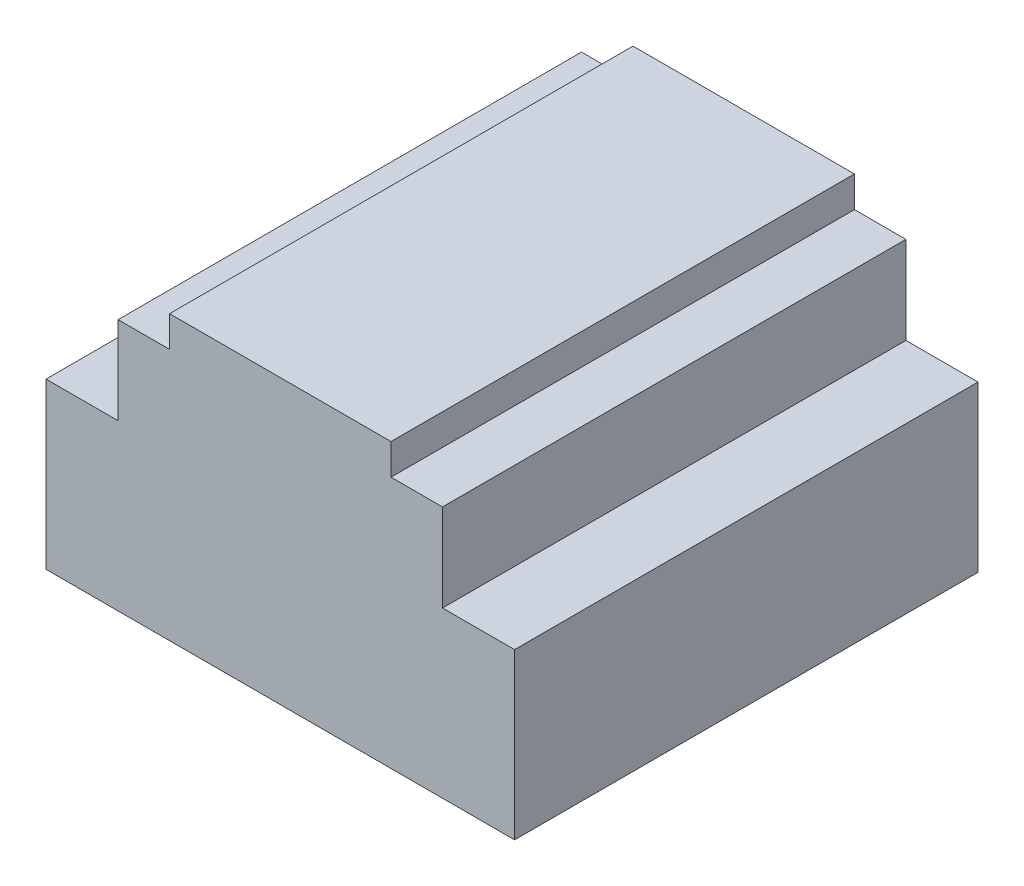
ISO-10303-21;
HEADER;
FILE_DESCRIPTION(('STEP AP214'),'2;1');
FILE_NAME('part.step','',(''),(''),'','','');
FILE_SCHEMA(('AUTOMOTIVE_DESIGN { 1 0 10303 214 1 1 1 1 }'));
ENDSEC;
DATA;
#1=APPLICATION_CONTEXT('core data for automotive mechanical design processes');
#2=APPLICATION_PROTOCOL_DEFINITION('international standard','automotive_design',2000,#1);
#3=PRODUCT_CONTEXT('',#1,'mechanical');
#4=PRODUCT('Part','Part','',(#3));
#5=PRODUCT_RELATED_PRODUCT_CATEGORY('part','',(#4));
#6=PRODUCT_DEFINITION_FORMATION('','',#4);
#7=PRODUCT_DEFINITION_CONTEXT('part definition',#1,'design');
#8=PRODUCT_DEFINITION('design','',#6,#7);
#9=PRODUCT_DEFINITION_SHAPE('','',#8);
#10=(LENGTH_UNIT() NAMED_UNIT(*) SI_UNIT(.MILLI.,.METRE.));
#11=(NAMED_UNIT(*) PLANE_ANGLE_UNIT() SI_UNIT($,.RADIAN.));
#12=(NAMED_UNIT(*) SI_UNIT($,.STERADIAN.) SOLID_ANGLE_UNIT());
#13=UNCERTAINTY_MEASURE_WITH_UNIT(LENGTH_MEASURE(1.E-05),#10,'distance_accuracy_value','');
#14=(GEOMETRIC_REPRESENTATION_CONTEXT(3) GLOBAL_UNCERTAINTY_ASSIGNED_CONTEXT((#13)) GLOBAL_UNIT_ASSIGNED_CONTEXT((#10,
#11,#12)) REPRESENTATION_CONTEXT('',''));
#15=CARTESIAN_POINT('',(0.,0.,0.));
#16=DIRECTION('',(0.,0.,1.));
#17=DIRECTION('',(1.,0.,0.));
#18=AXIS2_PLACEMENT_3D('',#15,#16,#17);
#19=CARTESIAN_POINT('',(0.,55.,90.));
#20=DIRECTION('',(0.,-1.,0.));
#21=DIRECTION('',(0.,0.,-1.));
#22=AXIS2_PLACEMENT_3D('',#19,#20,#21);
#23=PLANE('',#22);
#24=DIRECTION('',(0.,0.,1.));
#25=VECTOR('',#24,1.);
#26=CARTESIAN_POINT('',(24.,55.,0.));
#27=LINE('',#26,#25);
#28=CARTESIAN_POINT('',(24.,55.,0.));
#29=VERTEX_POINT('',#28);
#30=CARTESIAN_POINT('',(24.,55.,90.));
#31=VERTEX_POINT('',#30);
#32=EDGE_CURVE('E186',#29,#31,#27,.T.);
#33=ORIENTED_EDGE('',*,*,#32,.T.);
#34=DIRECTION('',(-1.,0.,0.));
#35=VECTOR('',#34,1.);
#36=CARTESIAN_POINT('',(0.,55.,90.));
#37=LINE('',#36,#35);
#38=CARTESIAN_POINT('',(67.,55.,90.));
#39=VERTEX_POINT('',#38);
#40=EDGE_CURVE('E155',#39,#31,#37,.T.);
#41=ORIENTED_EDGE('',*,*,#40,.F.);
#42=DIRECTION('',(0.,0.,1.));
#43=VECTOR('',#42,1.);
#44=CARTESIAN_POINT('',(67.,55.,0.));
#45=LINE('',#44,#43);
#46=CARTESIAN_POINT('',(67.,55.,0.));
#47=VERTEX_POINT('',#46);
#48=EDGE_CURVE('E148',#47,#39,#45,.T.);
#49=ORIENTED_EDGE('',*,*,#48,.F.);
#50=DIRECTION('',(-1.,0.,0.));
#51=VECTOR('',#50,1.);
#52=CARTESIAN_POINT('',(0.,55.,0.));
#53=LINE('',#52,#51);
#54=EDGE_CURVE('E160',#47,#29,#53,.T.);
#55=ORIENTED_EDGE('',*,*,#54,.T.);
#56=EDGE_LOOP('',(#33,#41,#49,#55));
#57=FACE_BOUND('',#56,.T.);
#58=ADVANCED_FACE('F37',(#57),#23,.F.);
#59=CARTESIAN_POINT('',(0.,0.,90.));
#60=DIRECTION('',(0.,0.,-1.));
#61=DIRECTION('',(-1.,0.,0.));
#62=AXIS2_PLACEMENT_3D('',#59,#60,#61);
#63=PLANE('',#62);
#64=DIRECTION('',(-1.,0.,0.));
#65=VECTOR('',#64,1.);
#66=CARTESIAN_POINT('',(0.,49.,90.));
#67=LINE('',#66,#65);
#68=CARTESIAN_POINT('',(24.,49.,90.));
#69=VERTEX_POINT('',#68);
#70=CARTESIAN_POINT('',(14.,49.,90.));
#71=VERTEX_POINT('',#70);
#72=EDGE_CURVE('E198',#69,#71,#67,.T.);
#73=ORIENTED_EDGE('',*,*,#72,.T.);
#74=DIRECTION('',(0.,1.,0.));
#75=VECTOR('',#74,1.);
#76=CARTESIAN_POINT('',(14.,49.,90.));
#77=LINE('',#76,#75);
#78=CARTESIAN_POINT('',(14.,32.,90.));
#79=VERTEX_POINT('',#78);
#80=EDGE_CURVE('E52',#79,#71,#77,.T.);
#81=ORIENTED_EDGE('',*,*,#80,.F.);
#82=DIRECTION('',(1.,0.,0.));
#83=VECTOR('',#82,1.);
#84=CARTESIAN_POINT('',(0.,32.,90.));
#85=LINE('',#84,#83);
#86=CARTESIAN_POINT('',(0.,32.,90.));
#87=VERTEX_POINT('',#86);
#88=EDGE_CURVE('E224',#87,#79,#85,.T.);
#89=ORIENTED_EDGE('',*,*,#88,.F.);
#90=DIRECTION('',(0.,-1.,0.));
#91=VECTOR('',#90,1.);
#92=CARTESIAN_POINT('',(0.,0.,90.));
#93=LINE('',#92,#91);
#94=CARTESIAN_POINT('',(0.,0.,90.));
#95=VERTEX_POINT('',#94);
#96=EDGE_CURVE('E143',#87,#95,#93,.T.);
#97=ORIENTED_EDGE('',*,*,#96,.T.);
#98=DIRECTION('',(1.,0.,0.));
#99=VECTOR('',#98,1.);
#100=CARTESIAN_POINT('',(0.,0.,90.));
#101=LINE('',#100,#99);
#102=CARTESIAN_POINT('',(91.,0.,90.));
#103=VERTEX_POINT('',#102);
#104=EDGE_CURVE('E173',#95,#103,#101,.T.);
#105=ORIENTED_EDGE('',*,*,#104,.T.);
#106=DIRECTION('',(0.,1.,0.));
#107=VECTOR('',#106,1.);
#108=CARTESIAN_POINT('',(91.,0.,90.));
#109=LINE('',#108,#107);
#110=CARTESIAN_POINT('',(91.,32.,90.));
#111=VERTEX_POINT('',#110);
#112=EDGE_CURVE('E167',#103,#111,#109,.T.);
#113=ORIENTED_EDGE('',*,*,#112,.T.);
#114=DIRECTION('',(1.,0.,0.));
#115=VECTOR('',#114,1.);
#116=CARTESIAN_POINT('',(91.,32.,90.));
#117=LINE('',#116,#115);
#118=CARTESIAN_POINT('',(77.,32.,90.));
#119=VERTEX_POINT('',#118);
#120=EDGE_CURVE('E212',#119,#111,#117,.T.);
#121=ORIENTED_EDGE('',*,*,#120,.F.);
#122=DIRECTION('',(0.,-1.,0.));
#123=VECTOR('',#122,1.);
#124=CARTESIAN_POINT('',(77.,49.,90.));
#125=LINE('',#124,#123);
#126=CARTESIAN_POINT('',(77.,49.,90.));
#127=VERTEX_POINT('',#126);
#128=EDGE_CURVE('E214',#127,#119,#125,.T.);
#129=ORIENTED_EDGE('',*,*,#128,.F.);
#130=DIRECTION('',(1.,0.,0.));
#131=VECTOR('',#130,1.);
#132=CARTESIAN_POINT('',(0.,49.,90.));
#133=LINE('',#132,#131);
#134=CARTESIAN_POINT('',(67.,49.,90.));
#135=VERTEX_POINT('',#134);
#136=EDGE_CURVE('E180',#135,#127,#133,.T.);
#137=ORIENTED_EDGE('',*,*,#136,.F.);
#138=DIRECTION('',(0.,1.,0.));
#139=VECTOR('',#138,1.);
#140=CARTESIAN_POINT('',(66.9999999999999,-1.54968630520594E-13,90.));
#141=LINE('',#140,#139);
#142=EDGE_CURVE('E184',#135,#39,#141,.T.);
#143=ORIENTED_EDGE('',*,*,#142,.T.);
#144=ORIENTED_EDGE('',*,*,#40,.T.);
#145=DIRECTION('',(0.,-1.,0.));
#146=VECTOR('',#145,1.);
#147=CARTESIAN_POINT('',(24.,0.,90.));
#148=LINE('',#147,#146);
#149=EDGE_CURVE('E195',#31,#69,#148,.T.);
#150=ORIENTED_EDGE('',*,*,#149,.T.);
#151=EDGE_LOOP('',(#73,#81,#89,#97,#105,#113,#121,#129,#137,#143,#144,#150));
#152=FACE_BOUND('',#151,.T.);
#153=ADVANCED_FACE('F242',(#152),#63,.F.);
#154=CARTESIAN_POINT('',(0.,0.,0.));
#155=DIRECTION('',(0.,0.,-1.));
#156=DIRECTION('',(-1.,0.,0.));
#157=AXIS2_PLACEMENT_3D('',#154,#155,#156);
#158=PLANE('',#157);
#159=DIRECTION('',(0.,1.,0.));
#160=VECTOR('',#159,1.);
#161=CARTESIAN_POINT('',(14.,49.,0.));
#162=LINE('',#161,#160);
#163=CARTESIAN_POINT('',(14.,32.,0.));
#164=VERTEX_POINT('',#163);
#165=CARTESIAN_POINT('',(14.,49.,0.));
#166=VERTEX_POINT('',#165);
#167=EDGE_CURVE('E136',#164,#166,#162,.T.);
#168=ORIENTED_EDGE('',*,*,#167,.T.);
#169=DIRECTION('',(-1.,0.,0.));
#170=VECTOR('',#169,1.);
#171=CARTESIAN_POINT('',(0.,49.,0.));
#172=LINE('',#171,#170);
#173=CARTESIAN_POINT('',(24.,49.,0.));
#174=VERTEX_POINT('',#173);
#175=EDGE_CURVE('E197',#174,#166,#172,.T.);
#176=ORIENTED_EDGE('',*,*,#175,.F.);
#177=DIRECTION('',(0.,-1.,0.));
#178=VECTOR('',#177,1.);
#179=CARTESIAN_POINT('',(24.,0.,0.));
#180=LINE('',#179,#178);
#181=EDGE_CURVE('E192',#29,#174,#180,.T.);
#182=ORIENTED_EDGE('',*,*,#181,.F.);
#183=ORIENTED_EDGE('',*,*,#54,.F.);
#184=DIRECTION('',(0.,1.,0.));
#185=VECTOR('',#184,1.);
#186=CARTESIAN_POINT('',(66.9999999999999,-1.54968630520594E-13,0.));
#187=LINE('',#186,#185);
#188=CARTESIAN_POINT('',(67.,49.,0.));
#189=VERTEX_POINT('',#188);
#190=EDGE_CURVE('E183',#189,#47,#187,.T.);
#191=ORIENTED_EDGE('',*,*,#190,.F.);
#192=DIRECTION('',(1.,0.,0.));
#193=VECTOR('',#192,1.);
#194=CARTESIAN_POINT('',(0.,49.,0.));
#195=LINE('',#194,#193);
#196=CARTESIAN_POINT('',(77.,49.,0.));
#197=VERTEX_POINT('',#196);
#198=EDGE_CURVE('E178',#189,#197,#195,.T.);
#199=ORIENTED_EDGE('',*,*,#198,.T.);
#200=DIRECTION('',(0.,-1.,0.));
#201=VECTOR('',#200,1.);
#202=CARTESIAN_POINT('',(77.,49.,0.));
#203=LINE('',#202,#201);
#204=CARTESIAN_POINT('',(77.,32.,0.));
#205=VERTEX_POINT('',#204);
#206=EDGE_CURVE('E60',#197,#205,#203,.T.);
#207=ORIENTED_EDGE('',*,*,#206,.T.);
#208=DIRECTION('',(1.,0.,0.));
#209=VECTOR('',#208,1.);
#210=CARTESIAN_POINT('',(91.,32.,0.));
#211=LINE('',#210,#209);
#212=CARTESIAN_POINT('',(91.,32.,0.));
#213=VERTEX_POINT('',#212);
#214=EDGE_CURVE('E208',#205,#213,#211,.T.);
#215=ORIENTED_EDGE('',*,*,#214,.T.);
#216=DIRECTION('',(0.,1.,0.));
#217=VECTOR('',#216,1.);
#218=CARTESIAN_POINT('',(91.,0.,0.));
#219=LINE('',#218,#217);
#220=CARTESIAN_POINT('',(91.,0.,0.));
#221=VERTEX_POINT('',#220);
#222=EDGE_CURVE('E150',#221,#213,#219,.T.);
#223=ORIENTED_EDGE('',*,*,#222,.F.);
#224=DIRECTION('',(1.,0.,0.));
#225=VECTOR('',#224,1.);
#226=CARTESIAN_POINT('',(0.,0.,0.));
#227=LINE('',#226,#225);
#228=CARTESIAN_POINT('',(0.,0.,0.));
#229=VERTEX_POINT('',#228);
#230=EDGE_CURVE('E147',#229,#221,#227,.T.);
#231=ORIENTED_EDGE('',*,*,#230,.F.);
#232=DIRECTION('',(0.,-1.,0.));
#233=VECTOR('',#232,1.);
#234=CARTESIAN_POINT('',(0.,0.,0.));
#235=LINE('',#234,#233);
#236=CARTESIAN_POINT('',(0.,32.,0.));
#237=VERTEX_POINT('',#236);
#238=EDGE_CURVE('E141',#237,#229,#235,.T.);
#239=ORIENTED_EDGE('',*,*,#238,.F.);
#240=DIRECTION('',(1.,0.,0.));
#241=VECTOR('',#240,1.);
#242=CARTESIAN_POINT('',(0.,32.,0.));
#243=LINE('',#242,#241);
#244=EDGE_CURVE('E125',#237,#164,#243,.T.);
#245=ORIENTED_EDGE('',*,*,#244,.T.);
#246=EDGE_LOOP('',(#168,#176,#182,#183,#191,#199,#207,#215,#223,#231,#239,#245));
#247=FACE_BOUND('',#246,.T.);
#248=ADVANCED_FACE('F145',(#247),#158,.T.);
#249=CARTESIAN_POINT('',(0.,0.,90.));
#250=DIRECTION('',(1.,0.,0.));
#251=DIRECTION('',(0.,0.,-1.));
#252=AXIS2_PLACEMENT_3D('',#249,#250,#251);
#253=PLANE('',#252);
#254=ORIENTED_EDGE('',*,*,#96,.F.);
#255=DIRECTION('',(0.,0.,1.));
#256=VECTOR('',#255,1.);
#257=CARTESIAN_POINT('',(0.,32.,0.));
#258=LINE('',#257,#256);
#259=EDGE_CURVE('E129',#237,#87,#258,.T.);
#260=ORIENTED_EDGE('',*,*,#259,.F.);
#261=ORIENTED_EDGE('',*,*,#238,.T.);
#262=DIRECTION('',(0.,0.,-1.));
#263=VECTOR('',#262,1.);
#264=CARTESIAN_POINT('',(0.,0.,90.));
#265=LINE('',#264,#263);
#266=EDGE_CURVE('E11',#95,#229,#265,.T.);
#267=ORIENTED_EDGE('',*,*,#266,.F.);
#268=EDGE_LOOP('',(#254,#260,#261,#267));
#269=FACE_BOUND('',#268,.T.);
#270=ADVANCED_FACE('F39',(#269),#253,.F.);
#271=CARTESIAN_POINT('',(0.,0.,90.));
#272=DIRECTION('',(0.,1.,0.));
#273=DIRECTION('',(0.,0.,1.));
#274=AXIS2_PLACEMENT_3D('',#271,#272,#273);
#275=PLANE('',#274);
#276=ORIENTED_EDGE('',*,*,#230,.T.);
#277=DIRECTION('',(0.,0.,-1.));
#278=VECTOR('',#277,1.);
#279=CARTESIAN_POINT('',(91.,0.,90.));
#280=LINE('',#279,#278);
#281=EDGE_CURVE('E45',#103,#221,#280,.T.);
#282=ORIENTED_EDGE('',*,*,#281,.F.);
#283=ORIENTED_EDGE('',*,*,#104,.F.);
#284=ORIENTED_EDGE('',*,*,#266,.T.);
#285=EDGE_LOOP('',(#276,#282,#283,#284));
#286=FACE_BOUND('',#285,.T.);
#287=ADVANCED_FACE('F271',(#286),#275,.F.);
#288=CARTESIAN_POINT('',(91.,0.,90.));
#289=DIRECTION('',(-1.,0.,0.));
#290=DIRECTION('',(0.,0.,1.));
#291=AXIS2_PLACEMENT_3D('',#288,#289,#290);
#292=PLANE('',#291);
#293=ORIENTED_EDGE('',*,*,#222,.T.);
#294=DIRECTION('',(0.,0.,1.));
#295=VECTOR('',#294,1.);
#296=CARTESIAN_POINT('',(91.,32.,0.));
#297=LINE('',#296,#295);
#298=EDGE_CURVE('E201',#213,#111,#297,.T.);
#299=ORIENTED_EDGE('',*,*,#298,.T.);
#300=ORIENTED_EDGE('',*,*,#112,.F.);
#301=ORIENTED_EDGE('',*,*,#281,.T.);
#302=EDGE_LOOP('',(#293,#299,#300,#301));
#303=FACE_BOUND('',#302,.T.);
#304=ADVANCED_FACE('F249',(#303),#292,.F.);
#305=CARTESIAN_POINT('',(66.9999999999999,-1.54968630520594E-13,0.));
#306=DIRECTION('',(1.,0.,0.));
#307=DIRECTION('',(0.,1.,0.));
#308=AXIS2_PLACEMENT_3D('',#305,#306,#307);
#309=PLANE('',#308);
#310=ORIENTED_EDGE('',*,*,#142,.F.);
#311=DIRECTION('',(0.,0.,1.));
#312=VECTOR('',#311,1.);
#313=CARTESIAN_POINT('',(67.,49.,0.));
#314=LINE('',#313,#312);
#315=EDGE_CURVE('E152',#189,#135,#314,.T.);
#316=ORIENTED_EDGE('',*,*,#315,.F.);
#317=ORIENTED_EDGE('',*,*,#190,.T.);
#318=ORIENTED_EDGE('',*,*,#48,.T.);
#319=EDGE_LOOP('',(#310,#316,#317,#318));
#320=FACE_BOUND('',#319,.T.);
#321=ADVANCED_FACE('F240',(#320),#309,.T.);
#322=CARTESIAN_POINT('',(0.,49.,0.));
#323=DIRECTION('',(0.,-1.,0.));
#324=DIRECTION('',(0.,0.,-1.));
#325=AXIS2_PLACEMENT_3D('',#322,#323,#324);
#326=PLANE('',#325);
#327=ORIENTED_EDGE('',*,*,#136,.T.);
#328=DIRECTION('',(0.,0.,1.));
#329=VECTOR('',#328,1.);
#330=CARTESIAN_POINT('',(77.,49.,0.));
#331=LINE('',#330,#329);
#332=EDGE_CURVE('E205',#197,#127,#331,.T.);
#333=ORIENTED_EDGE('',*,*,#332,.F.);
#334=ORIENTED_EDGE('',*,*,#198,.F.);
#335=ORIENTED_EDGE('',*,*,#315,.T.);
#336=EDGE_LOOP('',(#327,#333,#334,#335));
#337=FACE_BOUND('',#336,.T.);
#338=ADVANCED_FACE('F245',(#337),#326,.F.);
#339=CARTESIAN_POINT('',(0.,49.,0.));
#340=DIRECTION('',(0.,1.,0.));
#341=DIRECTION('',(0.,0.,1.));
#342=AXIS2_PLACEMENT_3D('',#339,#340,#341);
#343=PLANE('',#342);
#344=DIRECTION('',(0.,0.,1.));
#345=VECTOR('',#344,1.);
#346=CARTESIAN_POINT('',(14.,49.,0.));
#347=LINE('',#346,#345);
#348=EDGE_CURVE('E217',#166,#71,#347,.T.);
#349=ORIENTED_EDGE('',*,*,#348,.T.);
#350=ORIENTED_EDGE('',*,*,#72,.F.);
#351=DIRECTION('',(0.,0.,1.));
#352=VECTOR('',#351,1.);
#353=CARTESIAN_POINT('',(24.,49.,0.));
#354=LINE('',#353,#352);
#355=EDGE_CURVE('E190',#174,#69,#354,.T.);
#356=ORIENTED_EDGE('',*,*,#355,.F.);
#357=ORIENTED_EDGE('',*,*,#175,.T.);
#358=EDGE_LOOP('',(#349,#350,#356,#357));
#359=FACE_BOUND('',#358,.T.);
#360=ADVANCED_FACE('F230',(#359),#343,.T.);
#361=CARTESIAN_POINT('',(24.,0.,0.));
#362=DIRECTION('',(-1.,0.,0.));
#363=DIRECTION('',(0.,0.,1.));
#364=AXIS2_PLACEMENT_3D('',#361,#362,#363);
#365=PLANE('',#364);
#366=ORIENTED_EDGE('',*,*,#149,.F.);
#367=ORIENTED_EDGE('',*,*,#32,.F.);
#368=ORIENTED_EDGE('',*,*,#181,.T.);
#369=ORIENTED_EDGE('',*,*,#355,.T.);
#370=EDGE_LOOP('',(#366,#367,#368,#369));
#371=FACE_BOUND('',#370,.T.);
#372=ADVANCED_FACE('F233',(#371),#365,.T.);
#373=CARTESIAN_POINT('',(91.,32.,0.));
#374=DIRECTION('',(0.,-1.,0.));
#375=DIRECTION('',(0.,0.,-1.));
#376=AXIS2_PLACEMENT_3D('',#373,#374,#375);
#377=PLANE('',#376);
#378=ORIENTED_EDGE('',*,*,#120,.T.);
#379=ORIENTED_EDGE('',*,*,#298,.F.);
#380=ORIENTED_EDGE('',*,*,#214,.F.);
#381=DIRECTION('',(0.,0.,1.));
#382=VECTOR('',#381,1.);
#383=CARTESIAN_POINT('',(77.,32.,0.));
#384=LINE('',#383,#382);
#385=EDGE_CURVE('E207',#205,#119,#384,.T.);
#386=ORIENTED_EDGE('',*,*,#385,.T.);
#387=EDGE_LOOP('',(#378,#379,#380,#386));
#388=FACE_BOUND('',#387,.T.);
#389=ADVANCED_FACE('F250',(#388),#377,.F.);
#390=CARTESIAN_POINT('',(77.,49.,0.));
#391=DIRECTION('',(-1.,0.,0.));
#392=DIRECTION('',(0.,0.,1.));
#393=AXIS2_PLACEMENT_3D('',#390,#391,#392);
#394=PLANE('',#393);
#395=ORIENTED_EDGE('',*,*,#128,.T.);
#396=ORIENTED_EDGE('',*,*,#385,.F.);
#397=ORIENTED_EDGE('',*,*,#206,.F.);
#398=ORIENTED_EDGE('',*,*,#332,.T.);
#399=EDGE_LOOP('',(#395,#396,#397,#398));
#400=FACE_BOUND('',#399,.T.);
#401=ADVANCED_FACE('F251',(#400),#394,.F.);
#402=CARTESIAN_POINT('',(14.,49.,0.));
#403=DIRECTION('',(1.,0.,0.));
#404=DIRECTION('',(0.,0.,-1.));
#405=AXIS2_PLACEMENT_3D('',#402,#403,#404);
#406=PLANE('',#405);
#407=ORIENTED_EDGE('',*,*,#80,.T.);
#408=ORIENTED_EDGE('',*,*,#348,.F.);
#409=ORIENTED_EDGE('',*,*,#167,.F.);
#410=DIRECTION('',(0.,0.,1.));
#411=VECTOR('',#410,1.);
#412=CARTESIAN_POINT('',(14.,32.,0.));
#413=LINE('',#412,#411);
#414=EDGE_CURVE('E131',#164,#79,#413,.T.);
#415=ORIENTED_EDGE('',*,*,#414,.T.);
#416=EDGE_LOOP('',(#407,#408,#409,#415));
#417=FACE_BOUND('',#416,.T.);
#418=ADVANCED_FACE('F253',(#417),#406,.F.);
#419=CARTESIAN_POINT('',(0.,32.,0.));
#420=DIRECTION('',(0.,-1.,0.));
#421=DIRECTION('',(0.,0.,-1.));
#422=AXIS2_PLACEMENT_3D('',#419,#420,#421);
#423=PLANE('',#422);
#424=ORIENTED_EDGE('',*,*,#88,.T.);
#425=ORIENTED_EDGE('',*,*,#414,.F.);
#426=ORIENTED_EDGE('',*,*,#244,.F.);
#427=ORIENTED_EDGE('',*,*,#259,.T.);
#428=EDGE_LOOP('',(#424,#425,#426,#427));
#429=FACE_BOUND('',#428,.T.);
#430=ADVANCED_FACE('F128',(#429),#423,.F.);
#431=CLOSED_SHELL('',(#58,#153,#248,#270,#287,#304,#321,#338,#360,#372,#389,#401,#418,#430));
#432=MANIFOLD_SOLID_BREP('B2',#431);
#433=ADVANCED_BREP_SHAPE_REPRESENTATION('',(#18,#432),#14);
#434=SHAPE_DEFINITION_REPRESENTATION(#9,#433);
ENDSEC;
END-ISO-10303-21;
